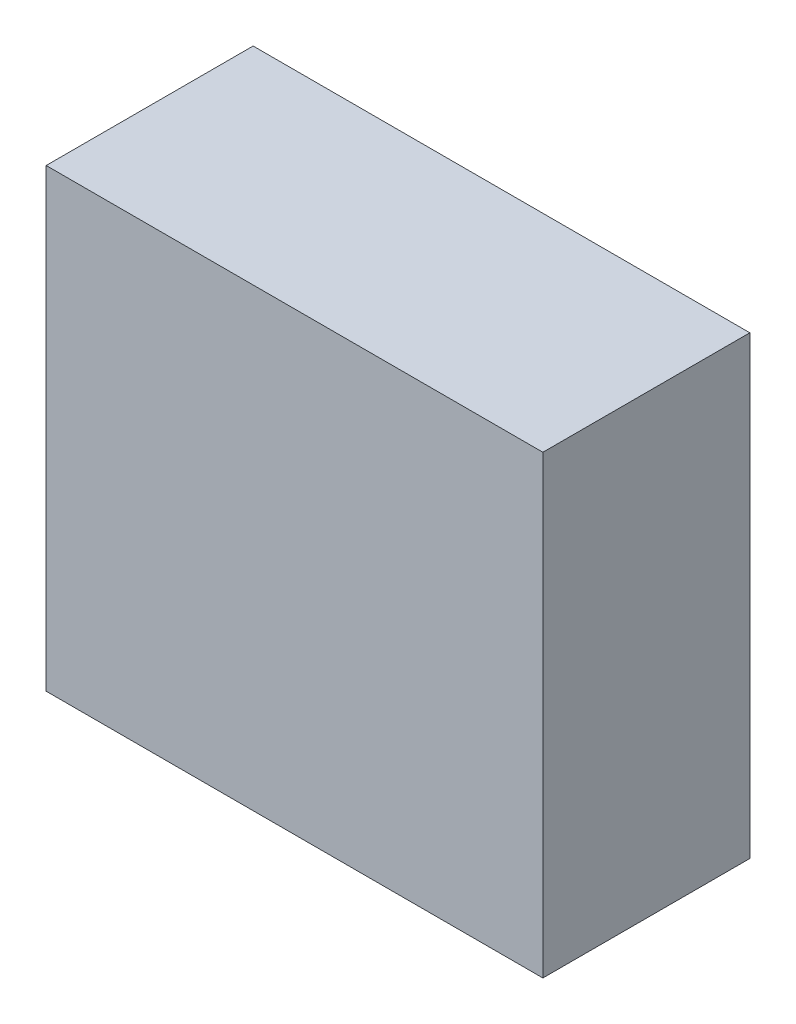
ISO-10303-21;
HEADER;
FILE_DESCRIPTION(('STEP AP214'),'2;1');
FILE_NAME('part.step','',(''),(''),'','','');
FILE_SCHEMA(('AUTOMOTIVE_DESIGN { 1 0 10303 214 1 1 1 1 }'));
ENDSEC;
DATA;
#1=APPLICATION_CONTEXT('core data for automotive mechanical design processes');
#2=APPLICATION_PROTOCOL_DEFINITION('international standard','automotive_design',2000,#1);
#3=PRODUCT_CONTEXT('',#1,'mechanical');
#4=PRODUCT('Part','Part','',(#3));
#5=PRODUCT_RELATED_PRODUCT_CATEGORY('part','',(#4));
#6=PRODUCT_DEFINITION_FORMATION('','',#4);
#7=PRODUCT_DEFINITION_CONTEXT('part definition',#1,'design');
#8=PRODUCT_DEFINITION('design','',#6,#7);
#9=PRODUCT_DEFINITION_SHAPE('','',#8);
#10=(LENGTH_UNIT() NAMED_UNIT(*) SI_UNIT(.MILLI.,.METRE.));
#11=(NAMED_UNIT(*) PLANE_ANGLE_UNIT() SI_UNIT($,.RADIAN.));
#12=(NAMED_UNIT(*) SI_UNIT($,.STERADIAN.) SOLID_ANGLE_UNIT());
#13=UNCERTAINTY_MEASURE_WITH_UNIT(LENGTH_MEASURE(1.E-05),#10,'distance_accuracy_value','');
#14=(GEOMETRIC_REPRESENTATION_CONTEXT(3) GLOBAL_UNCERTAINTY_ASSIGNED_CONTEXT((#13)) GLOBAL_UNIT_ASSIGNED_CONTEXT((#10,
#11,#12)) REPRESENTATION_CONTEXT('',''));
#15=CARTESIAN_POINT('',(0.,0.,0.));
#16=DIRECTION('',(0.,0.,1.));
#17=DIRECTION('',(1.,0.,0.));
#18=AXIS2_PLACEMENT_3D('',#15,#16,#17);
#19=CARTESIAN_POINT('',(-76.2,69.85,63.5));
#20=DIRECTION('',(1.,0.,0.));
#21=DIRECTION('',(0.,1.,0.));
#22=AXIS2_PLACEMENT_3D('',#19,#20,#21);
#23=PLANE('',#22);
#24=DIRECTION('',(0.,-1.,0.));
#25=VECTOR('',#24,1.);
#26=CARTESIAN_POINT('',(-76.2,69.85,0.));
#27=LINE('',#26,#25);
#28=CARTESIAN_POINT('',(-76.2,69.85,0.));
#29=VERTEX_POINT('',#28);
#30=CARTESIAN_POINT('',(-76.2,-69.85,0.));
#31=VERTEX_POINT('',#30);
#32=EDGE_CURVE('E98',#29,#31,#27,.T.);
#33=ORIENTED_EDGE('',*,*,#32,.T.);
#34=DIRECTION('',(0.,0.,-1.));
#35=VECTOR('',#34,1.);
#36=CARTESIAN_POINT('',(-76.2,-69.85,63.5));
#37=LINE('',#36,#35);
#38=CARTESIAN_POINT('',(-76.2,-69.85,63.5));
#39=VERTEX_POINT('',#38);
#40=EDGE_CURVE('E11',#39,#31,#37,.T.);
#41=ORIENTED_EDGE('',*,*,#40,.F.);
#42=DIRECTION('',(0.,-1.,0.));
#43=VECTOR('',#42,1.);
#44=CARTESIAN_POINT('',(-76.2,69.85,63.5));
#45=LINE('',#44,#43);
#46=CARTESIAN_POINT('',(-76.2,69.85,63.5));
#47=VERTEX_POINT('',#46);
#48=EDGE_CURVE('E86',#47,#39,#45,.T.);
#49=ORIENTED_EDGE('',*,*,#48,.F.);
#50=DIRECTION('',(0.,0.,-1.));
#51=VECTOR('',#50,1.);
#52=CARTESIAN_POINT('',(-76.2,69.85,63.5));
#53=LINE('',#52,#51);
#54=EDGE_CURVE('E94',#47,#29,#53,.T.);
#55=ORIENTED_EDGE('',*,*,#54,.T.);
#56=EDGE_LOOP('',(#33,#41,#49,#55));
#57=FACE_BOUND('',#56,.T.);
#58=ADVANCED_FACE('F35',(#57),#23,.F.);
#59=CARTESIAN_POINT('',(76.2,-69.85,63.5));
#60=DIRECTION('',(0.,1.,0.));
#61=DIRECTION('',(-1.,0.,0.));
#62=AXIS2_PLACEMENT_3D('',#59,#60,#61);
#63=PLANE('',#62);
#64=DIRECTION('',(1.,0.,0.));
#65=VECTOR('',#64,1.);
#66=CARTESIAN_POINT('',(76.2,-69.85,0.));
#67=LINE('',#66,#65);
#68=CARTESIAN_POINT('',(76.2,-69.85,0.));
#69=VERTEX_POINT('',#68);
#70=EDGE_CURVE('E90',#31,#69,#67,.T.);
#71=ORIENTED_EDGE('',*,*,#70,.T.);
#72=DIRECTION('',(0.,0.,-1.));
#73=VECTOR('',#72,1.);
#74=CARTESIAN_POINT('',(76.2,-69.85,63.5));
#75=LINE('',#74,#73);
#76=CARTESIAN_POINT('',(76.2,-69.85,63.5));
#77=VERTEX_POINT('',#76);
#78=EDGE_CURVE('E43',#77,#69,#75,.T.);
#79=ORIENTED_EDGE('',*,*,#78,.F.);
#80=DIRECTION('',(1.,0.,0.));
#81=VECTOR('',#80,1.);
#82=CARTESIAN_POINT('',(76.2,-69.85,63.5));
#83=LINE('',#82,#81);
#84=EDGE_CURVE('E81',#39,#77,#83,.T.);
#85=ORIENTED_EDGE('',*,*,#84,.F.);
#86=ORIENTED_EDGE('',*,*,#40,.T.);
#87=EDGE_LOOP('',(#71,#79,#85,#86));
#88=FACE_BOUND('',#87,.T.);
#89=ADVANCED_FACE('F89',(#88),#63,.F.);
#90=CARTESIAN_POINT('',(76.2,69.85,63.5));
#91=DIRECTION('',(-1.,0.,0.));
#92=DIRECTION('',(0.,0.,1.));
#93=AXIS2_PLACEMENT_3D('',#90,#91,#92);
#94=PLANE('',#93);
#95=DIRECTION('',(0.,1.,0.));
#96=VECTOR('',#95,1.);
#97=CARTESIAN_POINT('',(76.2,69.85,0.));
#98=LINE('',#97,#96);
#99=CARTESIAN_POINT('',(76.2,69.85,0.));
#100=VERTEX_POINT('',#99);
#101=EDGE_CURVE('E68',#69,#100,#98,.T.);
#102=ORIENTED_EDGE('',*,*,#101,.T.);
#103=DIRECTION('',(0.,0.,-1.));
#104=VECTOR('',#103,1.);
#105=CARTESIAN_POINT('',(76.2,69.85,63.5));
#106=LINE('',#105,#104);
#107=CARTESIAN_POINT('',(76.2,69.85,63.5));
#108=VERTEX_POINT('',#107);
#109=EDGE_CURVE('E91',#108,#100,#106,.T.);
#110=ORIENTED_EDGE('',*,*,#109,.F.);
#111=DIRECTION('',(0.,1.,0.));
#112=VECTOR('',#111,1.);
#113=CARTESIAN_POINT('',(76.2,69.85,63.5));
#114=LINE('',#113,#112);
#115=EDGE_CURVE('E84',#77,#108,#114,.T.);
#116=ORIENTED_EDGE('',*,*,#115,.F.);
#117=ORIENTED_EDGE('',*,*,#78,.T.);
#118=EDGE_LOOP('',(#102,#110,#116,#117));
#119=FACE_BOUND('',#118,.T.);
#120=ADVANCED_FACE('F92',(#119),#94,.F.);
#121=CARTESIAN_POINT('',(76.2,69.85,63.5));
#122=DIRECTION('',(0.,-1.,0.));
#123=DIRECTION('',(1.,0.,0.));
#124=AXIS2_PLACEMENT_3D('',#121,#122,#123);
#125=PLANE('',#124);
#126=DIRECTION('',(-1.,0.,0.));
#127=VECTOR('',#126,1.);
#128=CARTESIAN_POINT('',(76.2,69.85,0.));
#129=LINE('',#128,#127);
#130=EDGE_CURVE('E74',#100,#29,#129,.T.);
#131=ORIENTED_EDGE('',*,*,#130,.T.);
#132=ORIENTED_EDGE('',*,*,#54,.F.);
#133=DIRECTION('',(-1.,0.,0.));
#134=VECTOR('',#133,1.);
#135=CARTESIAN_POINT('',(76.2,69.85,63.5));
#136=LINE('',#135,#134);
#137=EDGE_CURVE('E51',#108,#47,#136,.T.);
#138=ORIENTED_EDGE('',*,*,#137,.F.);
#139=ORIENTED_EDGE('',*,*,#109,.T.);
#140=EDGE_LOOP('',(#131,#132,#138,#139));
#141=FACE_BOUND('',#140,.T.);
#142=ADVANCED_FACE('F105',(#141),#125,.F.);
#143=CARTESIAN_POINT('',(0.,0.,63.5));
#144=DIRECTION('',(0.,0.,-1.));
#145=DIRECTION('',(-1.,0.,0.));
#146=AXIS2_PLACEMENT_3D('',#143,#144,#145);
#147=PLANE('',#146);
#148=ORIENTED_EDGE('',*,*,#48,.T.);
#149=ORIENTED_EDGE('',*,*,#84,.T.);
#150=ORIENTED_EDGE('',*,*,#115,.T.);
#151=ORIENTED_EDGE('',*,*,#137,.T.);
#152=EDGE_LOOP('',(#148,#149,#150,#151));
#153=FACE_BOUND('',#152,.T.);
#154=ADVANCED_FACE('F82',(#153),#147,.F.);
#155=CARTESIAN_POINT('',(0.,0.,0.));
#156=DIRECTION('',(0.,0.,-1.));
#157=DIRECTION('',(-1.,0.,0.));
#158=AXIS2_PLACEMENT_3D('',#155,#156,#157);
#159=PLANE('',#158);
#160=ORIENTED_EDGE('',*,*,#32,.F.);
#161=ORIENTED_EDGE('',*,*,#130,.F.);
#162=ORIENTED_EDGE('',*,*,#101,.F.);
#163=ORIENTED_EDGE('',*,*,#70,.F.);
#164=EDGE_LOOP('',(#160,#161,#162,#163));
#165=FACE_BOUND('',#164,.T.);
#166=ADVANCED_FACE('F108',(#165),#159,.T.);
#167=CLOSED_SHELL('',(#58,#89,#120,#142,#154,#166));
#168=MANIFOLD_SOLID_BREP('B2',#167);
#169=ADVANCED_BREP_SHAPE_REPRESENTATION('',(#18,#168),#14);
#170=SHAPE_DEFINITION_REPRESENTATION(#9,#169);
ENDSEC;
END-ISO-10303-21;
